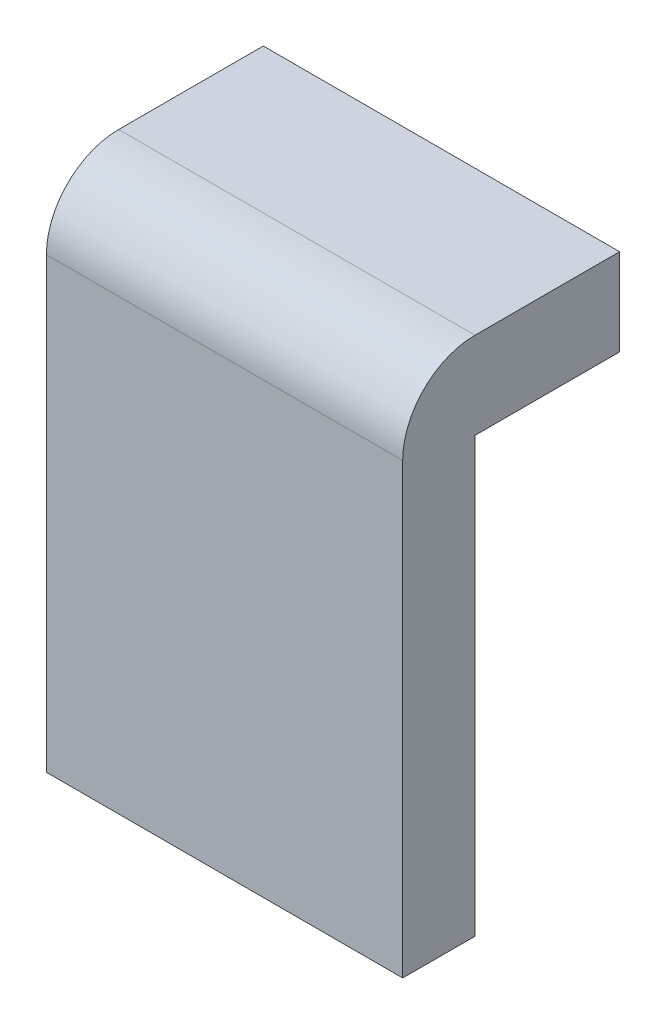
ISO-10303-21;
HEADER;
FILE_DESCRIPTION(('STEP AP214'),'2;1');
FILE_NAME('part.step','',(''),(''),'','','');
FILE_SCHEMA(('AUTOMOTIVE_DESIGN { 1 0 10303 214 1 1 1 1 }'));
ENDSEC;
DATA;
#1=APPLICATION_CONTEXT('core data for automotive mechanical design processes');
#2=APPLICATION_PROTOCOL_DEFINITION('international standard','automotive_design',2000,#1);
#3=PRODUCT_CONTEXT('',#1,'mechanical');
#4=PRODUCT('Part','Part','',(#3));
#5=PRODUCT_RELATED_PRODUCT_CATEGORY('part','',(#4));
#6=PRODUCT_DEFINITION_FORMATION('','',#4);
#7=PRODUCT_DEFINITION_CONTEXT('part definition',#1,'design');
#8=PRODUCT_DEFINITION('design','',#6,#7);
#9=PRODUCT_DEFINITION_SHAPE('','',#8);
#10=(LENGTH_UNIT() NAMED_UNIT(*) SI_UNIT(.MILLI.,.METRE.));
#11=(NAMED_UNIT(*) PLANE_ANGLE_UNIT() SI_UNIT($,.RADIAN.));
#12=(NAMED_UNIT(*) SI_UNIT($,.STERADIAN.) SOLID_ANGLE_UNIT());
#13=UNCERTAINTY_MEASURE_WITH_UNIT(LENGTH_MEASURE(1.E-05),#10,'distance_accuracy_value','');
#14=(GEOMETRIC_REPRESENTATION_CONTEXT(3) GLOBAL_UNCERTAINTY_ASSIGNED_CONTEXT((#13)) GLOBAL_UNIT_ASSIGNED_CONTEXT((#10,
#11,#12)) REPRESENTATION_CONTEXT('',''));
#15=CARTESIAN_POINT('',(0.,0.,0.));
#16=DIRECTION('',(0.,0.,1.));
#17=DIRECTION('',(1.,0.,0.));
#18=AXIS2_PLACEMENT_3D('',#15,#16,#17);
#19=CARTESIAN_POINT('',(-8.34906661620967,8.30000000000001,12.2546737770755));
#20=DIRECTION('',(0.,0.,1.));
#21=DIRECTION('',(0.,-1.,0.));
#22=AXIS2_PLACEMENT_3D('',#19,#20,#21);
#23=PLANE('',#22);
#24=DIRECTION('',(1.,0.,0.));
#25=VECTOR('',#24,1.);
#26=CARTESIAN_POINT('',(-15.8147962412963,6.80000000000003,12.2546737770755));
#27=LINE('',#26,#25);
#28=CARTESIAN_POINT('',(11.6728048391445,6.80000000000003,12.2546737770755));
#29=VERTEX_POINT('',#28);
#30=CARTESIAN_POINT('',(12.9049555955852,6.80000000000003,12.2546737770755));
#31=VERTEX_POINT('',#30);
#32=EDGE_CURVE('E113',#29,#31,#27,.T.);
#33=ORIENTED_EDGE('',*,*,#32,.F.);
#34=DIRECTION('',(0.,1.,0.));
#35=VECTOR('',#34,1.);
#36=CARTESIAN_POINT('',(11.6728048391445,5.35753839337147,12.2546737770755));
#37=LINE('',#36,#35);
#38=CARTESIAN_POINT('',(11.6728048391445,8.30000000000001,12.2546737770755));
#39=VERTEX_POINT('',#38);
#40=EDGE_CURVE('E148',#39,#29,#37,.F.);
#41=ORIENTED_EDGE('',*,*,#40,.F.);
#42=DIRECTION('',(1.,0.,0.));
#43=VECTOR('',#42,1.);
#44=CARTESIAN_POINT('',(-8.34906661620967,8.30000000000001,12.2546737770755));
#45=LINE('',#44,#43);
#46=CARTESIAN_POINT('',(12.9049555955852,8.30000000000001,12.2546737770755));
#47=VERTEX_POINT('',#46);
#48=EDGE_CURVE('E133',#39,#47,#45,.T.);
#49=ORIENTED_EDGE('',*,*,#48,.T.);
#50=DIRECTION('',(0.,1.,0.));
#51=VECTOR('',#50,1.);
#52=CARTESIAN_POINT('',(12.9049555955852,5.35753839337147,12.2546737770755));
#53=LINE('',#52,#51);
#54=EDGE_CURVE('E105',#31,#47,#53,.T.);
#55=ORIENTED_EDGE('',*,*,#54,.F.);
#56=EDGE_LOOP('',(#33,#41,#49,#55));
#57=FACE_BOUND('',#56,.T.);
#58=ADVANCED_FACE('F17',(#57),#23,.F.);
#59=CARTESIAN_POINT('',(-8.34906661620967,8.30000000000001,11.7546737770755));
#60=DIRECTION('',(0.,1.,0.));
#61=DIRECTION('',(0.,0.,1.));
#62=AXIS2_PLACEMENT_3D('',#59,#60,#61);
#63=PLANE('',#62);
#64=ORIENTED_EDGE('',*,*,#48,.F.);
#65=DIRECTION('',(0.,0.,1.));
#66=VECTOR('',#65,1.);
#67=CARTESIAN_POINT('',(11.6728048391445,8.30000000000001,12.5046737770755));
#68=LINE('',#67,#66);
#69=CARTESIAN_POINT('',(11.6728048391445,8.30000000000001,11.7546737770755));
#70=VERTEX_POINT('',#69);
#71=EDGE_CURVE('E153',#70,#39,#68,.T.);
#72=ORIENTED_EDGE('',*,*,#71,.F.);
#73=DIRECTION('',(1.,0.,0.));
#74=VECTOR('',#73,1.);
#75=CARTESIAN_POINT('',(11.6728048391445,8.30000000000001,11.7546737770755));
#76=LINE('',#75,#74);
#77=CARTESIAN_POINT('',(12.9049555955852,8.30000000000001,11.7546737770755));
#78=VERTEX_POINT('',#77);
#79=EDGE_CURVE('E124',#78,#70,#76,.F.);
#80=ORIENTED_EDGE('',*,*,#79,.F.);
#81=DIRECTION('',(0.,0.,-1.));
#82=VECTOR('',#81,1.);
#83=CARTESIAN_POINT('',(12.9049555955852,8.30000000000001,12.5046737770755));
#84=LINE('',#83,#82);
#85=EDGE_CURVE('E129',#47,#78,#84,.T.);
#86=ORIENTED_EDGE('',*,*,#85,.F.);
#87=EDGE_LOOP('',(#64,#72,#80,#86));
#88=FACE_BOUND('',#87,.T.);
#89=ADVANCED_FACE('F175',(#88),#63,.F.);
#90=CARTESIAN_POINT('',(11.6728048391445,5.35753839337146,11.7546737770755));
#91=DIRECTION('',(0.,0.,-1.));
#92=DIRECTION('',(0.,1.,0.));
#93=AXIS2_PLACEMENT_3D('',#90,#91,#92);
#94=PLANE('',#93);
#95=ORIENTED_EDGE('',*,*,#79,.T.);
#96=DIRECTION('',(0.,1.,0.));
#97=VECTOR('',#96,1.);
#98=CARTESIAN_POINT('',(11.6728048391445,5.35753839337147,11.7546737770755));
#99=LINE('',#98,#97);
#100=CARTESIAN_POINT('',(11.6728048391445,8.6,11.7546737770755));
#101=VERTEX_POINT('',#100);
#102=EDGE_CURVE('E119',#101,#70,#99,.F.);
#103=ORIENTED_EDGE('',*,*,#102,.F.);
#104=DIRECTION('',(1.,0.,0.));
#105=VECTOR('',#104,1.);
#106=CARTESIAN_POINT('',(-8.34906661620967,8.6,11.7546737770755));
#107=LINE('',#106,#105);
#108=CARTESIAN_POINT('',(12.9049555955852,8.6,11.7546737770755));
#109=VERTEX_POINT('',#108);
#110=EDGE_CURVE('E122',#101,#109,#107,.T.);
#111=ORIENTED_EDGE('',*,*,#110,.T.);
#112=DIRECTION('',(0.,1.,0.));
#113=VECTOR('',#112,1.);
#114=CARTESIAN_POINT('',(12.9049555955852,5.35753839337147,11.7546737770755));
#115=LINE('',#114,#113);
#116=EDGE_CURVE('E97',#78,#109,#115,.T.);
#117=ORIENTED_EDGE('',*,*,#116,.F.);
#118=EDGE_LOOP('',(#95,#103,#111,#117));
#119=FACE_BOUND('',#118,.T.);
#120=ADVANCED_FACE('F172',(#119),#94,.T.);
#121=CARTESIAN_POINT('',(-8.34906661620967,8.6,11.7546737770755));
#122=DIRECTION('',(0.,-1.,0.));
#123=DIRECTION('',(0.,0.,-1.));
#124=AXIS2_PLACEMENT_3D('',#121,#122,#123);
#125=PLANE('',#124);
#126=ORIENTED_EDGE('',*,*,#110,.F.);
#127=DIRECTION('',(0.,0.,1.));
#128=VECTOR('',#127,1.);
#129=CARTESIAN_POINT('',(11.6728048391445,8.6,12.5046737770755));
#130=LINE('',#129,#128);
#131=CARTESIAN_POINT('',(11.6728048391445,8.6,12.2546737770755));
#132=VERTEX_POINT('',#131);
#133=EDGE_CURVE('E83',#132,#101,#130,.F.);
#134=ORIENTED_EDGE('',*,*,#133,.F.);
#135=DIRECTION('',(1.,0.,0.));
#136=VECTOR('',#135,1.);
#137=CARTESIAN_POINT('',(-8.34906661620967,8.6,12.2546737770755));
#138=LINE('',#137,#136);
#139=CARTESIAN_POINT('',(12.9049555955852,8.6,12.2546737770755));
#140=VERTEX_POINT('',#139);
#141=EDGE_CURVE('E79',#140,#132,#138,.F.);
#142=ORIENTED_EDGE('',*,*,#141,.F.);
#143=DIRECTION('',(0.,0.,-1.));
#144=VECTOR('',#143,1.);
#145=CARTESIAN_POINT('',(12.9049555955852,8.6,12.5046737770755));
#146=LINE('',#145,#144);
#147=EDGE_CURVE('E94',#109,#140,#146,.F.);
#148=ORIENTED_EDGE('',*,*,#147,.F.);
#149=EDGE_LOOP('',(#126,#134,#142,#148));
#150=FACE_BOUND('',#149,.T.);
#151=ADVANCED_FACE('F168',(#150),#125,.F.);
#152=CARTESIAN_POINT('',(-8.34906661620967,8.35,12.2546737770755));
#153=DIRECTION('',(1.,0.,0.));
#154=DIRECTION('',(0.,0.,-1.));
#155=AXIS2_PLACEMENT_3D('',#152,#153,#154);
#156=CYLINDRICAL_SURFACE('',#155,0.249999999999995);
#157=CARTESIAN_POINT('',(11.6728048391445,8.35,12.2546737770755));
#158=DIRECTION('',(1.,0.,0.));
#159=DIRECTION('',(0.,0.,-1.));
#160=AXIS2_PLACEMENT_3D('',#157,#158,#159);
#161=CIRCLE('',#160,0.249999999999995);
#162=CARTESIAN_POINT('',(11.6728048391445,8.35,12.5046737770755));
#163=VERTEX_POINT('',#162);
#164=EDGE_CURVE('E20',#163,#132,#161,.F.);
#165=ORIENTED_EDGE('',*,*,#164,.F.);
#166=DIRECTION('',(1.,0.,0.));
#167=VECTOR('',#166,1.);
#168=CARTESIAN_POINT('',(11.6728048391445,8.35,12.5046737770755));
#169=LINE('',#168,#167);
#170=CARTESIAN_POINT('',(12.9049555955852,8.35,12.5046737770755));
#171=VERTEX_POINT('',#170);
#172=EDGE_CURVE('E77',#171,#163,#169,.F.);
#173=ORIENTED_EDGE('',*,*,#172,.F.);
#174=CARTESIAN_POINT('',(12.9049555955852,8.35,12.2546737770755));
#175=DIRECTION('',(1.,0.,0.));
#176=DIRECTION('',(0.,0.,-1.));
#177=AXIS2_PLACEMENT_3D('',#174,#175,#176);
#178=CIRCLE('',#177,0.249999999999995);
#179=EDGE_CURVE('E106',#140,#171,#178,.T.);
#180=ORIENTED_EDGE('',*,*,#179,.F.);
#181=ORIENTED_EDGE('',*,*,#141,.T.);
#182=EDGE_LOOP('',(#165,#173,#180,#181));
#183=FACE_BOUND('',#182,.T.);
#184=ADVANCED_FACE('F74',(#183),#156,.T.);
#185=CARTESIAN_POINT('',(11.6728048391445,5.35753839337147,12.5046737770755));
#186=DIRECTION('',(-1.,0.,0.));
#187=DIRECTION('',(0.,0.,1.));
#188=AXIS2_PLACEMENT_3D('',#185,#186,#187);
#189=PLANE('',#188);
#190=DIRECTION('',(0.,0.,-1.));
#191=VECTOR('',#190,1.);
#192=CARTESIAN_POINT('',(11.6728048391445,6.80000000000003,12.5046737770755));
#193=LINE('',#192,#191);
#194=CARTESIAN_POINT('',(11.6728048391445,6.80000000000003,12.5046737770755));
#195=VERTEX_POINT('',#194);
#196=EDGE_CURVE('E89',#195,#29,#193,.T.);
#197=ORIENTED_EDGE('',*,*,#196,.F.);
#198=DIRECTION('',(0.,-1.,0.));
#199=VECTOR('',#198,1.);
#200=CARTESIAN_POINT('',(11.6728048391445,5.35753839337147,12.5046737770755));
#201=LINE('',#200,#199);
#202=EDGE_CURVE('E85',#163,#195,#201,.T.);
#203=ORIENTED_EDGE('',*,*,#202,.F.);
#204=ORIENTED_EDGE('',*,*,#164,.T.);
#205=ORIENTED_EDGE('',*,*,#133,.T.);
#206=ORIENTED_EDGE('',*,*,#102,.T.);
#207=ORIENTED_EDGE('',*,*,#71,.T.);
#208=ORIENTED_EDGE('',*,*,#40,.T.);
#209=EDGE_LOOP('',(#197,#203,#204,#205,#206,#207,#208));
#210=FACE_BOUND('',#209,.T.);
#211=ADVANCED_FACE('F86',(#210),#189,.T.);
#212=CARTESIAN_POINT('',(-15.8147962412963,6.80000000000003,12.5046737770755));
#213=DIRECTION('',(0.,-1.,0.));
#214=DIRECTION('',(0.,0.,-1.));
#215=AXIS2_PLACEMENT_3D('',#212,#213,#214);
#216=PLANE('',#215);
#217=DIRECTION('',(1.,0.,0.));
#218=VECTOR('',#217,1.);
#219=CARTESIAN_POINT('',(11.6728048391445,6.80000000000003,12.5046737770755));
#220=LINE('',#219,#218);
#221=CARTESIAN_POINT('',(12.9049555955852,6.80000000000003,12.5046737770755));
#222=VERTEX_POINT('',#221);
#223=EDGE_CURVE('E26',#195,#222,#220,.T.);
#224=ORIENTED_EDGE('',*,*,#223,.F.);
#225=ORIENTED_EDGE('',*,*,#196,.T.);
#226=ORIENTED_EDGE('',*,*,#32,.T.);
#227=DIRECTION('',(0.,0.,-1.));
#228=VECTOR('',#227,1.);
#229=CARTESIAN_POINT('',(12.9049555955852,6.80000000000003,12.5046737770755));
#230=LINE('',#229,#228);
#231=EDGE_CURVE('E35',#222,#31,#230,.T.);
#232=ORIENTED_EDGE('',*,*,#231,.F.);
#233=EDGE_LOOP('',(#224,#225,#226,#232));
#234=FACE_BOUND('',#233,.T.);
#235=ADVANCED_FACE('F179',(#234),#216,.T.);
#236=CARTESIAN_POINT('',(12.9049555955852,5.35753839337147,12.5046737770755));
#237=DIRECTION('',(1.,0.,0.));
#238=DIRECTION('',(0.,0.,-1.));
#239=AXIS2_PLACEMENT_3D('',#236,#237,#238);
#240=PLANE('',#239);
#241=ORIENTED_EDGE('',*,*,#116,.T.);
#242=ORIENTED_EDGE('',*,*,#147,.T.);
#243=ORIENTED_EDGE('',*,*,#179,.T.);
#244=DIRECTION('',(0.,-1.,0.));
#245=VECTOR('',#244,1.);
#246=CARTESIAN_POINT('',(12.9049555955852,5.35753839337147,12.5046737770755));
#247=LINE('',#246,#245);
#248=EDGE_CURVE('E11',#222,#171,#247,.F.);
#249=ORIENTED_EDGE('',*,*,#248,.F.);
#250=ORIENTED_EDGE('',*,*,#231,.T.);
#251=ORIENTED_EDGE('',*,*,#54,.T.);
#252=ORIENTED_EDGE('',*,*,#85,.T.);
#253=EDGE_LOOP('',(#241,#242,#243,#249,#250,#251,#252));
#254=FACE_BOUND('',#253,.T.);
#255=ADVANCED_FACE('F164',(#254),#240,.T.);
#256=CARTESIAN_POINT('',(11.6728048391445,5.35753839337147,12.5046737770755));
#257=DIRECTION('',(0.,0.,1.));
#258=DIRECTION('',(0.,-1.,0.));
#259=AXIS2_PLACEMENT_3D('',#256,#257,#258);
#260=PLANE('',#259);
#261=ORIENTED_EDGE('',*,*,#223,.T.);
#262=ORIENTED_EDGE('',*,*,#248,.T.);
#263=ORIENTED_EDGE('',*,*,#172,.T.);
#264=ORIENTED_EDGE('',*,*,#202,.T.);
#265=EDGE_LOOP('',(#261,#262,#263,#264));
#266=FACE_BOUND('',#265,.T.);
#267=ADVANCED_FACE('F93',(#266),#260,.T.);
#268=CLOSED_SHELL('',(#58,#89,#120,#151,#184,#211,#235,#255,#267));
#269=MANIFOLD_SOLID_BREP('B1',#268);
#270=ADVANCED_BREP_SHAPE_REPRESENTATION('',(#18,#269),#14);
#271=SHAPE_DEFINITION_REPRESENTATION(#9,#270);
ENDSEC;
END-ISO-10303-21;
